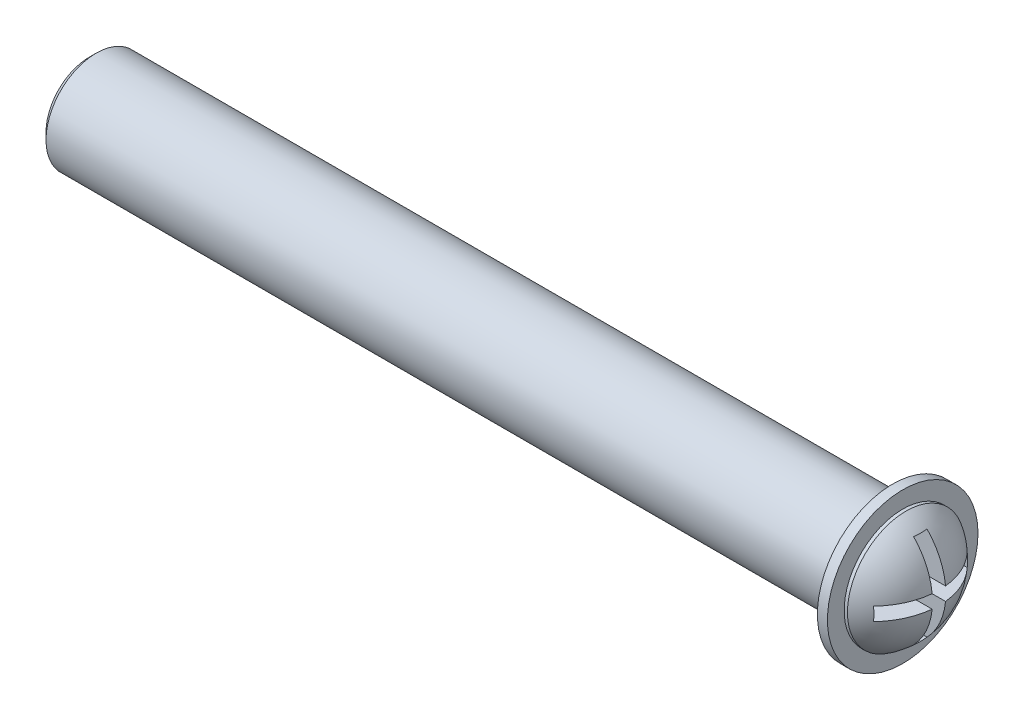
ISO-10303-21;
HEADER;
FILE_DESCRIPTION(('STEP AP214'),'2;1');
FILE_NAME('part.step','',(''),(''),'','','');
FILE_SCHEMA(('AUTOMOTIVE_DESIGN { 1 0 10303 214 1 1 1 1 }'));
ENDSEC;
DATA;
#1=APPLICATION_CONTEXT('core data for automotive mechanical design processes');
#2=APPLICATION_PROTOCOL_DEFINITION('international standard','automotive_design',2000,#1);
#3=PRODUCT_CONTEXT('',#1,'mechanical');
#4=PRODUCT('Part','Part','',(#3));
#5=PRODUCT_RELATED_PRODUCT_CATEGORY('part','',(#4));
#6=PRODUCT_DEFINITION_FORMATION('','',#4);
#7=PRODUCT_DEFINITION_CONTEXT('part definition',#1,'design');
#8=PRODUCT_DEFINITION('design','',#6,#7);
#9=PRODUCT_DEFINITION_SHAPE('','',#8);
#10=(LENGTH_UNIT() NAMED_UNIT(*) SI_UNIT(.MILLI.,.METRE.));
#11=(NAMED_UNIT(*) PLANE_ANGLE_UNIT() SI_UNIT($,.RADIAN.));
#12=(NAMED_UNIT(*) SI_UNIT($,.STERADIAN.) SOLID_ANGLE_UNIT());
#13=UNCERTAINTY_MEASURE_WITH_UNIT(LENGTH_MEASURE(1.E-05),#10,'distance_accuracy_value','');
#14=(GEOMETRIC_REPRESENTATION_CONTEXT(3) GLOBAL_UNCERTAINTY_ASSIGNED_CONTEXT((#13)) GLOBAL_UNIT_ASSIGNED_CONTEXT((#10,
#11,#12)) REPRESENTATION_CONTEXT('',''));
#15=CARTESIAN_POINT('',(0.,0.,0.));
#16=DIRECTION('',(0.,0.,1.));
#17=DIRECTION('',(1.,0.,0.));
#18=AXIS2_PLACEMENT_3D('',#15,#16,#17);
#19=CARTESIAN_POINT('',(-0.63125,0.,0.));
#20=DIRECTION('',(0.,0.,1.));
#21=DIRECTION('',(1.,0.,0.));
#22=AXIS2_PLACEMENT_3D('',#19,#20,#21);
#23=SPHERICAL_SURFACE('',#22,2.03125);
#24=CARTESIAN_POINT('',(0.4,0.,0.));
#25=DIRECTION('',(1.,0.,0.));
#26=DIRECTION('',(0.,0.,-1.));
#27=AXIS2_PLACEMENT_3D('',#24,#25,#26);
#28=CIRCLE('',#27,1.75);
#29=CARTESIAN_POINT('',(0.4,0.,-1.75));
#30=VERTEX_POINT('',#29);
#31=EDGE_CURVE('E197',#30,#30,#28,.T.);
#32=ORIENTED_EDGE('',*,*,#31,.T.);
#33=EDGE_LOOP('',(#32));
#34=FACE_BOUND('',#33,.T.);
#35=CARTESIAN_POINT('',(-0.63125,1.4,0.));
#36=DIRECTION('',(0.,-1.,0.));
#37=DIRECTION('',(0.,0.,-1.));
#38=AXIS2_PLACEMENT_3D('',#35,#36,#37);
#39=CIRCLE('',#38,1.47172570898928);
#40=CARTESIAN_POINT('',(0.826822893411026,1.4,0.2));
#41=VERTEX_POINT('',#40);
#42=CARTESIAN_POINT('',(0.826822893411026,1.4,-0.2));
#43=VERTEX_POINT('',#42);
#44=EDGE_CURVE('E239',#41,#43,#39,.F.);
#45=ORIENTED_EDGE('',*,*,#44,.T.);
#46=CARTESIAN_POINT('',(-0.63125,0.,-0.2));
#47=DIRECTION('',(0.,0.,1.));
#48=DIRECTION('',(0.,-1.,0.));
#49=AXIS2_PLACEMENT_3D('',#46,#47,#48);
#50=CIRCLE('',#49,2.02137986595791);
#51=CARTESIAN_POINT('',(1.38021130027401,0.2,-0.2));
#52=VERTEX_POINT('',#51);
#53=EDGE_CURVE('E60',#43,#52,#50,.F.);
#54=ORIENTED_EDGE('',*,*,#53,.T.);
#55=CARTESIAN_POINT('',(-0.63125,0.2,0.));
#56=DIRECTION('',(0.,-1.,0.));
#57=DIRECTION('',(0.,0.,-1.));
#58=AXIS2_PLACEMENT_3D('',#55,#56,#57);
#59=CIRCLE('',#58,2.02137986595791);
#60=CARTESIAN_POINT('',(0.826822893411026,0.2,-1.4));
#61=VERTEX_POINT('',#60);
#62=EDGE_CURVE('E207',#52,#61,#59,.F.);
#63=ORIENTED_EDGE('',*,*,#62,.T.);
#64=CARTESIAN_POINT('',(-0.63125,0.,-1.4));
#65=DIRECTION('',(0.,0.,1.));
#66=DIRECTION('',(1.,0.,0.));
#67=AXIS2_PLACEMENT_3D('',#64,#65,#66);
#68=CIRCLE('',#67,1.47172570898928);
#69=CARTESIAN_POINT('',(0.826822893411026,-0.2,-1.4));
#70=VERTEX_POINT('',#69);
#71=EDGE_CURVE('E212',#61,#70,#68,.F.);
#72=ORIENTED_EDGE('',*,*,#71,.T.);
#73=CARTESIAN_POINT('',(-0.63125,-0.2,0.));
#74=DIRECTION('',(0.,1.,0.));
#75=DIRECTION('',(0.,0.,1.));
#76=AXIS2_PLACEMENT_3D('',#73,#74,#75);
#77=CIRCLE('',#76,2.02137986595791);
#78=CARTESIAN_POINT('',(1.38021130027401,-0.2,-0.2));
#79=VERTEX_POINT('',#78);
#80=EDGE_CURVE('E215',#70,#79,#77,.F.);
#81=ORIENTED_EDGE('',*,*,#80,.T.);
#82=CARTESIAN_POINT('',(-0.63125,0.,-0.2));
#83=DIRECTION('',(0.,0.,1.));
#84=DIRECTION('',(0.,-1.,0.));
#85=AXIS2_PLACEMENT_3D('',#82,#83,#84);
#86=CIRCLE('',#85,2.02137986595791);
#87=CARTESIAN_POINT('',(0.826822893411026,-1.4,-0.2));
#88=VERTEX_POINT('',#87);
#89=EDGE_CURVE('E218',#79,#88,#86,.F.);
#90=ORIENTED_EDGE('',*,*,#89,.T.);
#91=CARTESIAN_POINT('',(-0.63125,-1.4,0.));
#92=DIRECTION('',(0.,1.,0.));
#93=DIRECTION('',(0.,0.,1.));
#94=AXIS2_PLACEMENT_3D('',#91,#92,#93);
#95=CIRCLE('',#94,1.47172570898928);
#96=CARTESIAN_POINT('',(0.826822893411026,-1.4,0.2));
#97=VERTEX_POINT('',#96);
#98=EDGE_CURVE('E221',#88,#97,#95,.F.);
#99=ORIENTED_EDGE('',*,*,#98,.T.);
#100=CARTESIAN_POINT('',(-0.63125,0.,0.2));
#101=DIRECTION('',(0.,0.,-1.));
#102=DIRECTION('',(0.,1.,0.));
#103=AXIS2_PLACEMENT_3D('',#100,#101,#102);
#104=CIRCLE('',#103,2.02137986595791);
#105=CARTESIAN_POINT('',(1.38021130027401,-0.2,0.2));
#106=VERTEX_POINT('',#105);
#107=EDGE_CURVE('E224',#97,#106,#104,.F.);
#108=ORIENTED_EDGE('',*,*,#107,.T.);
#109=CARTESIAN_POINT('',(-0.63125,-0.2,0.));
#110=DIRECTION('',(0.,1.,0.));
#111=DIRECTION('',(0.,0.,1.));
#112=AXIS2_PLACEMENT_3D('',#109,#110,#111);
#113=CIRCLE('',#112,2.02137986595791);
#114=CARTESIAN_POINT('',(0.826822893411026,-0.2,1.4));
#115=VERTEX_POINT('',#114);
#116=EDGE_CURVE('E227',#106,#115,#113,.F.);
#117=ORIENTED_EDGE('',*,*,#116,.T.);
#118=CARTESIAN_POINT('',(-0.63125,0.,1.4));
#119=DIRECTION('',(0.,0.,-1.));
#120=DIRECTION('',(-1.,0.,0.));
#121=AXIS2_PLACEMENT_3D('',#118,#119,#120);
#122=CIRCLE('',#121,1.47172570898928);
#123=CARTESIAN_POINT('',(0.826822893411026,0.2,1.4));
#124=VERTEX_POINT('',#123);
#125=EDGE_CURVE('E230',#115,#124,#122,.F.);
#126=ORIENTED_EDGE('',*,*,#125,.T.);
#127=CARTESIAN_POINT('',(-0.63125,0.2,0.));
#128=DIRECTION('',(0.,-1.,0.));
#129=DIRECTION('',(0.,0.,-1.));
#130=AXIS2_PLACEMENT_3D('',#127,#128,#129);
#131=CIRCLE('',#130,2.02137986595791);
#132=CARTESIAN_POINT('',(1.38021130027401,0.2,0.2));
#133=VERTEX_POINT('',#132);
#134=EDGE_CURVE('E233',#124,#133,#131,.F.);
#135=ORIENTED_EDGE('',*,*,#134,.T.);
#136=CARTESIAN_POINT('',(-0.63125,0.,0.2));
#137=DIRECTION('',(0.,0.,-1.));
#138=DIRECTION('',(0.,1.,0.));
#139=AXIS2_PLACEMENT_3D('',#136,#137,#138);
#140=CIRCLE('',#139,2.02137986595791);
#141=EDGE_CURVE('E236',#133,#41,#140,.F.);
#142=ORIENTED_EDGE('',*,*,#141,.T.);
#143=EDGE_LOOP('',(#45,#54,#63,#72,#81,#90,#99,#108,#117,#126,#135,#142));
#144=FACE_BOUND('',#143,.T.);
#145=ADVANCED_FACE('F37',(#34,#144),#23,.T.);
#146=CARTESIAN_POINT('',(0.3,0.,0.));
#147=DIRECTION('',(-1.,0.,0.));
#148=DIRECTION('',(0.,0.,1.));
#149=AXIS2_PLACEMENT_3D('',#146,#147,#148);
#150=CYLINDRICAL_SURFACE('',#149,2.25);
#151=CARTESIAN_POINT('',(0.3,0.,0.));
#152=DIRECTION('',(1.,0.,0.));
#153=DIRECTION('',(0.,0.,-1.));
#154=AXIS2_PLACEMENT_3D('',#151,#152,#153);
#155=CIRCLE('',#154,2.25);
#156=CARTESIAN_POINT('',(0.3,0.,-2.25));
#157=VERTEX_POINT('',#156);
#158=EDGE_CURVE('E198',#157,#157,#155,.T.);
#159=ORIENTED_EDGE('',*,*,#158,.F.);
#160=EDGE_LOOP('',(#159));
#161=FACE_BOUND('',#160,.T.);
#162=CARTESIAN_POINT('',(0.,0.,0.));
#163=DIRECTION('',(1.,0.,0.));
#164=DIRECTION('',(0.,0.,-1.));
#165=AXIS2_PLACEMENT_3D('',#162,#163,#164);
#166=CIRCLE('',#165,2.25);
#167=CARTESIAN_POINT('',(0.,0.,-2.25));
#168=VERTEX_POINT('',#167);
#169=EDGE_CURVE('E202',#168,#168,#166,.T.);
#170=ORIENTED_EDGE('',*,*,#169,.T.);
#171=EDGE_LOOP('',(#170));
#172=FACE_BOUND('',#171,.T.);
#173=ADVANCED_FACE('F255',(#161,#172),#150,.T.);
#174=CARTESIAN_POINT('',(0.3,0.,0.));
#175=DIRECTION('',(1.,0.,0.));
#176=DIRECTION('',(0.,0.,-1.));
#177=AXIS2_PLACEMENT_3D('',#174,#175,#176);
#178=PLANE('',#177);
#179=CARTESIAN_POINT('',(0.3,0.,0.));
#180=DIRECTION('',(1.,0.,0.));
#181=DIRECTION('',(0.,0.,-1.));
#182=AXIS2_PLACEMENT_3D('',#179,#180,#181);
#183=CIRCLE('',#182,1.75);
#184=CARTESIAN_POINT('',(0.3,0.,-1.75));
#185=VERTEX_POINT('',#184);
#186=EDGE_CURVE('E132',#185,#185,#183,.T.);
#187=ORIENTED_EDGE('',*,*,#186,.F.);
#188=EDGE_LOOP('',(#187));
#189=FACE_BOUND('',#188,.T.);
#190=ORIENTED_EDGE('',*,*,#158,.T.);
#191=EDGE_LOOP('',(#190));
#192=FACE_BOUND('',#191,.T.);
#193=ADVANCED_FACE('F260',(#189,#192),#178,.T.);
#194=CARTESIAN_POINT('',(0.,0.,0.));
#195=DIRECTION('',(1.,0.,0.));
#196=DIRECTION('',(0.,0.,-1.));
#197=AXIS2_PLACEMENT_3D('',#194,#195,#196);
#198=PLANE('',#197);
#199=CARTESIAN_POINT('',(0.,0.,0.));
#200=DIRECTION('',(1.,0.,0.));
#201=DIRECTION('',(0.,0.,-1.));
#202=AXIS2_PLACEMENT_3D('',#199,#200,#201);
#203=CIRCLE('',#202,1.5);
#204=CARTESIAN_POINT('',(0.,0.,-1.5));
#205=VERTEX_POINT('',#204);
#206=EDGE_CURVE('E201',#205,#205,#203,.F.);
#207=ORIENTED_EDGE('',*,*,#206,.F.);
#208=EDGE_LOOP('',(#207));
#209=FACE_BOUND('',#208,.T.);
#210=ORIENTED_EDGE('',*,*,#169,.F.);
#211=EDGE_LOOP('',(#210));
#212=FACE_BOUND('',#211,.T.);
#213=ADVANCED_FACE('F265',(#209,#212),#198,.F.);
#214=CARTESIAN_POINT('',(-24.,0.,0.));
#215=DIRECTION('',(1.,0.,0.));
#216=DIRECTION('',(0.,0.,-1.));
#217=AXIS2_PLACEMENT_3D('',#214,#215,#216);
#218=CYLINDRICAL_SURFACE('',#217,1.5);
#219=CARTESIAN_POINT('',(-23.8,0.,0.));
#220=DIRECTION('',(-1.,0.,0.));
#221=DIRECTION('',(0.,0.,1.));
#222=AXIS2_PLACEMENT_3D('',#219,#220,#221);
#223=CIRCLE('',#222,1.5);
#224=CARTESIAN_POINT('',(-23.8,0.,1.5));
#225=VERTEX_POINT('',#224);
#226=EDGE_CURVE('E11',#225,#225,#223,.F.);
#227=ORIENTED_EDGE('',*,*,#226,.T.);
#228=EDGE_LOOP('',(#227));
#229=FACE_BOUND('',#228,.T.);
#230=ORIENTED_EDGE('',*,*,#206,.T.);
#231=EDGE_LOOP('',(#230));
#232=FACE_BOUND('',#231,.T.);
#233=ADVANCED_FACE('F268',(#229,#232),#218,.T.);
#234=CARTESIAN_POINT('',(-24.,0.,0.));
#235=DIRECTION('',(-1.,0.,0.));
#236=DIRECTION('',(0.,0.,1.));
#237=AXIS2_PLACEMENT_3D('',#234,#235,#236);
#238=PLANE('',#237);
#239=CARTESIAN_POINT('',(-24.,0.,0.));
#240=DIRECTION('',(-1.,0.,0.));
#241=DIRECTION('',(0.,0.,1.));
#242=AXIS2_PLACEMENT_3D('',#239,#240,#241);
#243=CIRCLE('',#242,1.3);
#244=CARTESIAN_POINT('',(-24.,0.,1.3));
#245=VERTEX_POINT('',#244);
#246=EDGE_CURVE('E45',#245,#245,#243,.T.);
#247=ORIENTED_EDGE('',*,*,#246,.T.);
#248=EDGE_LOOP('',(#247));
#249=FACE_BOUND('',#248,.T.);
#250=ADVANCED_FACE('F244',(#249),#238,.T.);
#251=CARTESIAN_POINT('',(0.4,0.,0.));
#252=DIRECTION('',(-1.,0.,0.));
#253=DIRECTION('',(0.,0.,1.));
#254=AXIS2_PLACEMENT_3D('',#251,#252,#253);
#255=CYLINDRICAL_SURFACE('',#254,1.75);
#256=ORIENTED_EDGE('',*,*,#31,.F.);
#257=EDGE_LOOP('',(#256));
#258=FACE_BOUND('',#257,.T.);
#259=ORIENTED_EDGE('',*,*,#186,.T.);
#260=EDGE_LOOP('',(#259));
#261=FACE_BOUND('',#260,.T.);
#262=ADVANCED_FACE('F278',(#258,#261),#255,.T.);
#263=CARTESIAN_POINT('',(2.,1.4,-0.2));
#264=DIRECTION('',(0.,0.,1.));
#265=DIRECTION('',(0.,-1.,0.));
#266=AXIS2_PLACEMENT_3D('',#263,#264,#265);
#267=PLANE('',#266);
#268=DIRECTION('',(-1.,0.,0.));
#269=VECTOR('',#268,1.);
#270=CARTESIAN_POINT('',(2.,1.4,-0.2));
#271=LINE('',#270,#269);
#272=CARTESIAN_POINT('',(0.,1.4,-0.2));
#273=VERTEX_POINT('',#272);
#274=EDGE_CURVE('E125',#43,#273,#271,.T.);
#275=ORIENTED_EDGE('',*,*,#274,.T.);
#276=DIRECTION('',(0.,1.,0.));
#277=VECTOR('',#276,1.);
#278=CARTESIAN_POINT('',(0.,1.4,-0.2));
#279=LINE('',#278,#277);
#280=CARTESIAN_POINT('',(0.,0.2,-0.2));
#281=VERTEX_POINT('',#280);
#282=EDGE_CURVE('E129',#281,#273,#279,.T.);
#283=ORIENTED_EDGE('',*,*,#282,.F.);
#284=DIRECTION('',(-1.,0.,0.));
#285=VECTOR('',#284,1.);
#286=CARTESIAN_POINT('',(2.,0.2,-0.2));
#287=LINE('',#286,#285);
#288=EDGE_CURVE('E175',#52,#281,#287,.T.);
#289=ORIENTED_EDGE('',*,*,#288,.F.);
#290=ORIENTED_EDGE('',*,*,#53,.F.);
#291=EDGE_LOOP('',(#275,#283,#289,#290));
#292=FACE_BOUND('',#291,.T.);
#293=ADVANCED_FACE('F127',(#292),#267,.T.);
#294=CARTESIAN_POINT('',(2.,1.4,0.2));
#295=DIRECTION('',(0.,-1.,0.));
#296=DIRECTION('',(0.,0.,-1.));
#297=AXIS2_PLACEMENT_3D('',#294,#295,#296);
#298=PLANE('',#297);
#299=DIRECTION('',(-1.,0.,0.));
#300=VECTOR('',#299,1.);
#301=CARTESIAN_POINT('',(2.,1.4,0.2));
#302=LINE('',#301,#300);
#303=CARTESIAN_POINT('',(0.,1.4,0.2));
#304=VERTEX_POINT('',#303);
#305=EDGE_CURVE('E133',#41,#304,#302,.T.);
#306=ORIENTED_EDGE('',*,*,#305,.T.);
#307=DIRECTION('',(0.,0.,1.));
#308=VECTOR('',#307,1.);
#309=CARTESIAN_POINT('',(0.,1.4,0.2));
#310=LINE('',#309,#308);
#311=EDGE_CURVE('E136',#273,#304,#310,.T.);
#312=ORIENTED_EDGE('',*,*,#311,.F.);
#313=ORIENTED_EDGE('',*,*,#274,.F.);
#314=ORIENTED_EDGE('',*,*,#44,.F.);
#315=EDGE_LOOP('',(#306,#312,#313,#314));
#316=FACE_BOUND('',#315,.T.);
#317=ADVANCED_FACE('F137',(#316),#298,.T.);
#318=CARTESIAN_POINT('',(2.,0.2,0.2));
#319=DIRECTION('',(0.,0.,-1.));
#320=DIRECTION('',(0.,1.,0.));
#321=AXIS2_PLACEMENT_3D('',#318,#319,#320);
#322=PLANE('',#321);
#323=DIRECTION('',(-1.,0.,0.));
#324=VECTOR('',#323,1.);
#325=CARTESIAN_POINT('',(2.,0.2,0.2));
#326=LINE('',#325,#324);
#327=CARTESIAN_POINT('',(0.,0.2,0.2));
#328=VERTEX_POINT('',#327);
#329=EDGE_CURVE('E192',#133,#328,#326,.T.);
#330=ORIENTED_EDGE('',*,*,#329,.T.);
#331=DIRECTION('',(0.,-1.,0.));
#332=VECTOR('',#331,1.);
#333=CARTESIAN_POINT('',(0.,0.2,0.2));
#334=LINE('',#333,#332);
#335=EDGE_CURVE('E142',#304,#328,#334,.T.);
#336=ORIENTED_EDGE('',*,*,#335,.F.);
#337=ORIENTED_EDGE('',*,*,#305,.F.);
#338=ORIENTED_EDGE('',*,*,#141,.F.);
#339=EDGE_LOOP('',(#330,#336,#337,#338));
#340=FACE_BOUND('',#339,.T.);
#341=ADVANCED_FACE('F286',(#340),#322,.T.);
#342=CARTESIAN_POINT('',(2.,0.2,1.4));
#343=DIRECTION('',(0.,-1.,0.));
#344=DIRECTION('',(0.,0.,-1.));
#345=AXIS2_PLACEMENT_3D('',#342,#343,#344);
#346=PLANE('',#345);
#347=DIRECTION('',(-1.,0.,0.));
#348=VECTOR('',#347,1.);
#349=CARTESIAN_POINT('',(2.,0.2,1.4));
#350=LINE('',#349,#348);
#351=CARTESIAN_POINT('',(0.,0.2,1.4));
#352=VERTEX_POINT('',#351);
#353=EDGE_CURVE('E190',#124,#352,#350,.T.);
#354=ORIENTED_EDGE('',*,*,#353,.T.);
#355=DIRECTION('',(0.,0.,1.));
#356=VECTOR('',#355,1.);
#357=CARTESIAN_POINT('',(0.,0.2,1.4));
#358=LINE('',#357,#356);
#359=EDGE_CURVE('E151',#328,#352,#358,.T.);
#360=ORIENTED_EDGE('',*,*,#359,.F.);
#361=ORIENTED_EDGE('',*,*,#329,.F.);
#362=ORIENTED_EDGE('',*,*,#134,.F.);
#363=EDGE_LOOP('',(#354,#360,#361,#362));
#364=FACE_BOUND('',#363,.T.);
#365=ADVANCED_FACE('F289',(#364),#346,.T.);
#366=CARTESIAN_POINT('',(2.,-0.2,1.4));
#367=DIRECTION('',(0.,0.,-1.));
#368=DIRECTION('',(-1.,0.,0.));
#369=AXIS2_PLACEMENT_3D('',#366,#367,#368);
#370=PLANE('',#369);
#371=DIRECTION('',(-1.,0.,0.));
#372=VECTOR('',#371,1.);
#373=CARTESIAN_POINT('',(2.,-0.2,1.4));
#374=LINE('',#373,#372);
#375=CARTESIAN_POINT('',(0.,-0.2,1.4));
#376=VERTEX_POINT('',#375);
#377=EDGE_CURVE('E188',#115,#376,#374,.T.);
#378=ORIENTED_EDGE('',*,*,#377,.T.);
#379=DIRECTION('',(0.,-1.,0.));
#380=VECTOR('',#379,1.);
#381=CARTESIAN_POINT('',(0.,-0.2,1.4));
#382=LINE('',#381,#380);
#383=EDGE_CURVE('E154',#352,#376,#382,.T.);
#384=ORIENTED_EDGE('',*,*,#383,.F.);
#385=ORIENTED_EDGE('',*,*,#353,.F.);
#386=ORIENTED_EDGE('',*,*,#125,.F.);
#387=EDGE_LOOP('',(#378,#384,#385,#386));
#388=FACE_BOUND('',#387,.T.);
#389=ADVANCED_FACE('F293',(#388),#370,.T.);
#390=CARTESIAN_POINT('',(2.,-0.2,0.2));
#391=DIRECTION('',(0.,1.,0.));
#392=DIRECTION('',(0.,0.,1.));
#393=AXIS2_PLACEMENT_3D('',#390,#391,#392);
#394=PLANE('',#393);
#395=DIRECTION('',(-1.,0.,0.));
#396=VECTOR('',#395,1.);
#397=CARTESIAN_POINT('',(2.,-0.2,0.2));
#398=LINE('',#397,#396);
#399=CARTESIAN_POINT('',(0.,-0.2,0.2));
#400=VERTEX_POINT('',#399);
#401=EDGE_CURVE('E186',#106,#400,#398,.T.);
#402=ORIENTED_EDGE('',*,*,#401,.T.);
#403=DIRECTION('',(0.,0.,-1.));
#404=VECTOR('',#403,1.);
#405=CARTESIAN_POINT('',(0.,-0.2,0.2));
#406=LINE('',#405,#404);
#407=EDGE_CURVE('E157',#376,#400,#406,.T.);
#408=ORIENTED_EDGE('',*,*,#407,.F.);
#409=ORIENTED_EDGE('',*,*,#377,.F.);
#410=ORIENTED_EDGE('',*,*,#116,.F.);
#411=EDGE_LOOP('',(#402,#408,#409,#410));
#412=FACE_BOUND('',#411,.T.);
#413=ADVANCED_FACE('F297',(#412),#394,.T.);
#414=CARTESIAN_POINT('',(2.,-1.4,0.2));
#415=DIRECTION('',(0.,0.,-1.));
#416=DIRECTION('',(0.,1.,0.));
#417=AXIS2_PLACEMENT_3D('',#414,#415,#416);
#418=PLANE('',#417);
#419=DIRECTION('',(-1.,0.,0.));
#420=VECTOR('',#419,1.);
#421=CARTESIAN_POINT('',(2.,-1.4,0.2));
#422=LINE('',#421,#420);
#423=CARTESIAN_POINT('',(0.,-1.4,0.2));
#424=VERTEX_POINT('',#423);
#425=EDGE_CURVE('E184',#97,#424,#422,.T.);
#426=ORIENTED_EDGE('',*,*,#425,.T.);
#427=DIRECTION('',(0.,-1.,0.));
#428=VECTOR('',#427,1.);
#429=CARTESIAN_POINT('',(0.,-1.4,0.2));
#430=LINE('',#429,#428);
#431=EDGE_CURVE('E160',#400,#424,#430,.T.);
#432=ORIENTED_EDGE('',*,*,#431,.F.);
#433=ORIENTED_EDGE('',*,*,#401,.F.);
#434=ORIENTED_EDGE('',*,*,#107,.F.);
#435=EDGE_LOOP('',(#426,#432,#433,#434));
#436=FACE_BOUND('',#435,.T.);
#437=ADVANCED_FACE('F301',(#436),#418,.T.);
#438=CARTESIAN_POINT('',(2.,-1.4,-0.2));
#439=DIRECTION('',(0.,1.,0.));
#440=DIRECTION('',(0.,0.,1.));
#441=AXIS2_PLACEMENT_3D('',#438,#439,#440);
#442=PLANE('',#441);
#443=DIRECTION('',(-1.,0.,0.));
#444=VECTOR('',#443,1.);
#445=CARTESIAN_POINT('',(2.,-1.4,-0.2));
#446=LINE('',#445,#444);
#447=CARTESIAN_POINT('',(0.,-1.4,-0.2));
#448=VERTEX_POINT('',#447);
#449=EDGE_CURVE('E182',#88,#448,#446,.T.);
#450=ORIENTED_EDGE('',*,*,#449,.T.);
#451=DIRECTION('',(0.,0.,-1.));
#452=VECTOR('',#451,1.);
#453=CARTESIAN_POINT('',(0.,-1.4,-0.2));
#454=LINE('',#453,#452);
#455=EDGE_CURVE('E163',#424,#448,#454,.T.);
#456=ORIENTED_EDGE('',*,*,#455,.F.);
#457=ORIENTED_EDGE('',*,*,#425,.F.);
#458=ORIENTED_EDGE('',*,*,#98,.F.);
#459=EDGE_LOOP('',(#450,#456,#457,#458));
#460=FACE_BOUND('',#459,.T.);
#461=ADVANCED_FACE('F305',(#460),#442,.T.);
#462=CARTESIAN_POINT('',(2.,-0.2,-0.2));
#463=DIRECTION('',(0.,0.,1.));
#464=DIRECTION('',(0.,-1.,0.));
#465=AXIS2_PLACEMENT_3D('',#462,#463,#464);
#466=PLANE('',#465);
#467=DIRECTION('',(-1.,0.,0.));
#468=VECTOR('',#467,1.);
#469=CARTESIAN_POINT('',(2.,-0.2,-0.2));
#470=LINE('',#469,#468);
#471=CARTESIAN_POINT('',(0.,-0.2,-0.2));
#472=VERTEX_POINT('',#471);
#473=EDGE_CURVE('E180',#79,#472,#470,.T.);
#474=ORIENTED_EDGE('',*,*,#473,.T.);
#475=DIRECTION('',(0.,1.,0.));
#476=VECTOR('',#475,1.);
#477=CARTESIAN_POINT('',(0.,-0.2,-0.2));
#478=LINE('',#477,#476);
#479=EDGE_CURVE('E166',#448,#472,#478,.T.);
#480=ORIENTED_EDGE('',*,*,#479,.F.);
#481=ORIENTED_EDGE('',*,*,#449,.F.);
#482=ORIENTED_EDGE('',*,*,#89,.F.);
#483=EDGE_LOOP('',(#474,#480,#481,#482));
#484=FACE_BOUND('',#483,.T.);
#485=ADVANCED_FACE('F309',(#484),#466,.T.);
#486=CARTESIAN_POINT('',(2.,-0.2,-1.4));
#487=DIRECTION('',(0.,1.,0.));
#488=DIRECTION('',(0.,0.,1.));
#489=AXIS2_PLACEMENT_3D('',#486,#487,#488);
#490=PLANE('',#489);
#491=DIRECTION('',(-1.,0.,0.));
#492=VECTOR('',#491,1.);
#493=CARTESIAN_POINT('',(2.,-0.2,-1.4));
#494=LINE('',#493,#492);
#495=CARTESIAN_POINT('',(0.,-0.2,-1.4));
#496=VERTEX_POINT('',#495);
#497=EDGE_CURVE('E178',#70,#496,#494,.T.);
#498=ORIENTED_EDGE('',*,*,#497,.T.);
#499=DIRECTION('',(0.,0.,-1.));
#500=VECTOR('',#499,1.);
#501=CARTESIAN_POINT('',(0.,-0.2,-1.4));
#502=LINE('',#501,#500);
#503=EDGE_CURVE('E169',#472,#496,#502,.T.);
#504=ORIENTED_EDGE('',*,*,#503,.F.);
#505=ORIENTED_EDGE('',*,*,#473,.F.);
#506=ORIENTED_EDGE('',*,*,#80,.F.);
#507=EDGE_LOOP('',(#498,#504,#505,#506));
#508=FACE_BOUND('',#507,.T.);
#509=ADVANCED_FACE('F313',(#508),#490,.T.);
#510=CARTESIAN_POINT('',(2.,0.2,-1.4));
#511=DIRECTION('',(0.,0.,1.));
#512=DIRECTION('',(1.,0.,0.));
#513=AXIS2_PLACEMENT_3D('',#510,#511,#512);
#514=PLANE('',#513);
#515=DIRECTION('',(-1.,0.,0.));
#516=VECTOR('',#515,1.);
#517=CARTESIAN_POINT('',(2.,0.2,-1.4));
#518=LINE('',#517,#516);
#519=CARTESIAN_POINT('',(0.,0.2,-1.4));
#520=VERTEX_POINT('',#519);
#521=EDGE_CURVE('E52',#61,#520,#518,.T.);
#522=ORIENTED_EDGE('',*,*,#521,.T.);
#523=DIRECTION('',(0.,1.,0.));
#524=VECTOR('',#523,1.);
#525=CARTESIAN_POINT('',(0.,0.2,-1.4));
#526=LINE('',#525,#524);
#527=EDGE_CURVE('E172',#496,#520,#526,.T.);
#528=ORIENTED_EDGE('',*,*,#527,.F.);
#529=ORIENTED_EDGE('',*,*,#497,.F.);
#530=ORIENTED_EDGE('',*,*,#71,.F.);
#531=EDGE_LOOP('',(#522,#528,#529,#530));
#532=FACE_BOUND('',#531,.T.);
#533=ADVANCED_FACE('F317',(#532),#514,.T.);
#534=CARTESIAN_POINT('',(2.,0.2,-0.2));
#535=DIRECTION('',(0.,-1.,0.));
#536=DIRECTION('',(0.,0.,-1.));
#537=AXIS2_PLACEMENT_3D('',#534,#535,#536);
#538=PLANE('',#537);
#539=ORIENTED_EDGE('',*,*,#288,.T.);
#540=DIRECTION('',(0.,0.,1.));
#541=VECTOR('',#540,1.);
#542=CARTESIAN_POINT('',(0.,0.2,-0.2));
#543=LINE('',#542,#541);
#544=EDGE_CURVE('E147',#520,#281,#543,.T.);
#545=ORIENTED_EDGE('',*,*,#544,.F.);
#546=ORIENTED_EDGE('',*,*,#521,.F.);
#547=ORIENTED_EDGE('',*,*,#62,.F.);
#548=EDGE_LOOP('',(#539,#545,#546,#547));
#549=FACE_BOUND('',#548,.T.);
#550=ADVANCED_FACE('F251',(#549),#538,.T.);
#551=CARTESIAN_POINT('',(0.,0.,0.));
#552=DIRECTION('',(1.,0.,0.));
#553=DIRECTION('',(0.,0.,-1.));
#554=AXIS2_PLACEMENT_3D('',#551,#552,#553);
#555=PLANE('',#554);
#556=ORIENTED_EDGE('',*,*,#282,.T.);
#557=ORIENTED_EDGE('',*,*,#311,.T.);
#558=ORIENTED_EDGE('',*,*,#335,.T.);
#559=ORIENTED_EDGE('',*,*,#359,.T.);
#560=ORIENTED_EDGE('',*,*,#383,.T.);
#561=ORIENTED_EDGE('',*,*,#407,.T.);
#562=ORIENTED_EDGE('',*,*,#431,.T.);
#563=ORIENTED_EDGE('',*,*,#455,.T.);
#564=ORIENTED_EDGE('',*,*,#479,.T.);
#565=ORIENTED_EDGE('',*,*,#503,.T.);
#566=ORIENTED_EDGE('',*,*,#527,.T.);
#567=ORIENTED_EDGE('',*,*,#544,.T.);
#568=EDGE_LOOP('',(#556,#557,#558,#559,#560,#561,#562,#563,#564,#565,#566,#567));
#569=FACE_BOUND('',#568,.T.);
#570=ADVANCED_FACE('F145',(#569),#555,.T.);
#571=CARTESIAN_POINT('',(-24.,0.,0.));
#572=DIRECTION('',(1.,0.,0.));
#573=DIRECTION('',(0.,0.,-1.));
#574=AXIS2_PLACEMENT_3D('',#571,#572,#573);
#575=CONICAL_SURFACE('',#574,1.3,0.785398163397454);
#576=ORIENTED_EDGE('',*,*,#226,.F.);
#577=EDGE_LOOP('',(#576));
#578=FACE_BOUND('',#577,.T.);
#579=ORIENTED_EDGE('',*,*,#246,.F.);
#580=EDGE_LOOP('',(#579));
#581=FACE_BOUND('',#580,.T.);
#582=ADVANCED_FACE('F39',(#578,#581),#575,.T.);
#583=CLOSED_SHELL('',(#145,#173,#193,#213,#233,#250,#262,#293,#317,#341,#365,#389,#413,#437,
#461,#485,#509,#533,#550,#570,#582));
#584=MANIFOLD_SOLID_BREP('B2',#583);
#585=ADVANCED_BREP_SHAPE_REPRESENTATION('',(#18,#584),#14);
#586=SHAPE_DEFINITION_REPRESENTATION(#9,#585);
ENDSEC;
END-ISO-10303-21;
